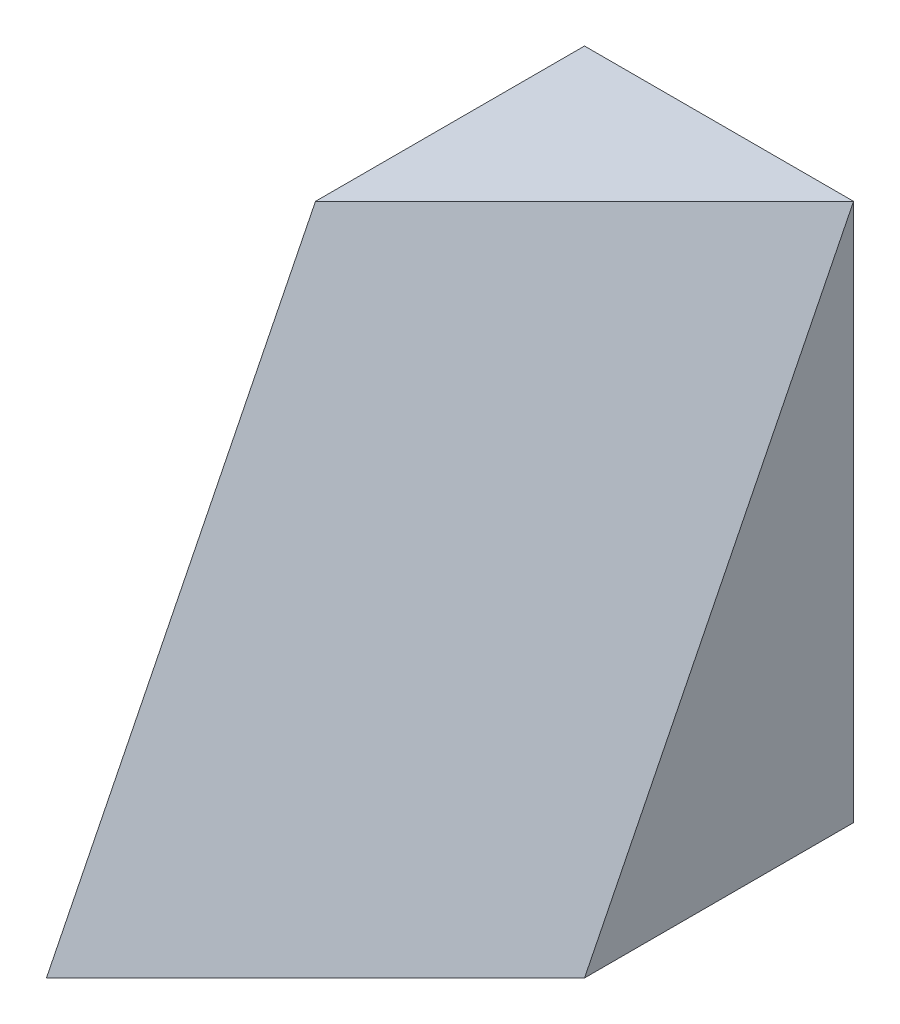
ISO-10303-21;
HEADER;
FILE_DESCRIPTION(('STEP AP214'),'2;1');
FILE_NAME('part.step','',(''),(''),'','','');
FILE_SCHEMA(('AUTOMOTIVE_DESIGN { 1 0 10303 214 1 1 1 1 }'));
ENDSEC;
DATA;
#1=APPLICATION_CONTEXT('core data for automotive mechanical design processes');
#2=APPLICATION_PROTOCOL_DEFINITION('international standard','automotive_design',2000,#1);
#3=PRODUCT_CONTEXT('',#1,'mechanical');
#4=PRODUCT('Part','Part','',(#3));
#5=PRODUCT_RELATED_PRODUCT_CATEGORY('part','',(#4));
#6=PRODUCT_DEFINITION_FORMATION('','',#4);
#7=PRODUCT_DEFINITION_CONTEXT('part definition',#1,'design');
#8=PRODUCT_DEFINITION('design','',#6,#7);
#9=PRODUCT_DEFINITION_SHAPE('','',#8);
#10=(LENGTH_UNIT() NAMED_UNIT(*) SI_UNIT(.MILLI.,.METRE.));
#11=(NAMED_UNIT(*) PLANE_ANGLE_UNIT() SI_UNIT($,.RADIAN.));
#12=(NAMED_UNIT(*) SI_UNIT($,.STERADIAN.) SOLID_ANGLE_UNIT());
#13=UNCERTAINTY_MEASURE_WITH_UNIT(LENGTH_MEASURE(1.E-05),#10,'distance_accuracy_value','');
#14=(GEOMETRIC_REPRESENTATION_CONTEXT(3) GLOBAL_UNCERTAINTY_ASSIGNED_CONTEXT((#13)) GLOBAL_UNIT_ASSIGNED_CONTEXT((#10,
#11,#12)) REPRESENTATION_CONTEXT('',''));
#15=CARTESIAN_POINT('',(0.,0.,0.));
#16=DIRECTION('',(0.,0.,1.));
#17=DIRECTION('',(1.,0.,0.));
#18=AXIS2_PLACEMENT_3D('',#15,#16,#17);
#19=CARTESIAN_POINT('',(0.,0.,40.));
#20=DIRECTION('',(0.,1.,0.));
#21=DIRECTION('',(0.,0.,1.));
#22=AXIS2_PLACEMENT_3D('',#19,#20,#21);
#23=PLANE('',#22);
#24=DIRECTION('',(0.,0.,-1.));
#25=VECTOR('',#24,1.);
#26=CARTESIAN_POINT('',(40.,0.,40.));
#27=LINE('',#26,#25);
#28=CARTESIAN_POINT('',(40.,0.,20.));
#29=VERTEX_POINT('',#28);
#30=CARTESIAN_POINT('',(40.,0.,0.));
#31=VERTEX_POINT('',#30);
#32=EDGE_CURVE('E40',#29,#31,#27,.T.);
#33=ORIENTED_EDGE('',*,*,#32,.F.);
#34=DIRECTION('',(0.707106781186548,0.,-0.707106781186547));
#35=VECTOR('',#34,1.);
#36=CARTESIAN_POINT('',(20.,0.,40.));
#37=LINE('',#36,#35);
#38=CARTESIAN_POINT('',(20.,0.,40.));
#39=VERTEX_POINT('',#38);
#40=EDGE_CURVE('E79',#39,#29,#37,.T.);
#41=ORIENTED_EDGE('',*,*,#40,.F.);
#42=DIRECTION('',(0.,0.,1.));
#43=VECTOR('',#42,1.);
#44=CARTESIAN_POINT('',(20.,0.,20.));
#45=LINE('',#44,#43);
#46=CARTESIAN_POINT('',(20.,0.,20.));
#47=VERTEX_POINT('',#46);
#48=EDGE_CURVE('E103',#47,#39,#45,.T.);
#49=ORIENTED_EDGE('',*,*,#48,.F.);
#50=DIRECTION('',(0.707106781186548,0.,0.707106781186547));
#51=VECTOR('',#50,1.);
#52=CARTESIAN_POINT('',(0.,0.,0.));
#53=LINE('',#52,#51);
#54=CARTESIAN_POINT('',(0.,0.,0.));
#55=VERTEX_POINT('',#54);
#56=EDGE_CURVE('E106',#55,#47,#53,.T.);
#57=ORIENTED_EDGE('',*,*,#56,.F.);
#58=DIRECTION('',(1.,0.,0.));
#59=VECTOR('',#58,1.);
#60=CARTESIAN_POINT('',(0.,0.,0.));
#61=LINE('',#60,#59);
#62=EDGE_CURVE('E92',#55,#31,#61,.T.);
#63=ORIENTED_EDGE('',*,*,#62,.T.);
#64=EDGE_LOOP('',(#33,#41,#49,#57,#63));
#65=FACE_BOUND('',#64,.T.);
#66=ADVANCED_FACE('F33',(#65),#23,.F.);
#67=CARTESIAN_POINT('',(40.,0.,40.));
#68=DIRECTION('',(-1.,0.,0.));
#69=DIRECTION('',(0.,0.,1.));
#70=AXIS2_PLACEMENT_3D('',#67,#68,#69);
#71=PLANE('',#70);
#72=DIRECTION('',(0.,1.,0.));
#73=VECTOR('',#72,1.);
#74=CARTESIAN_POINT('',(40.,0.,0.));
#75=LINE('',#74,#73);
#76=CARTESIAN_POINT('',(40.,40.,0.));
#77=VERTEX_POINT('',#76);
#78=EDGE_CURVE('E88',#31,#77,#75,.T.);
#79=ORIENTED_EDGE('',*,*,#78,.T.);
#80=DIRECTION('',(0.,-0.894427190999916,0.447213595499958));
#81=VECTOR('',#80,1.);
#82=CARTESIAN_POINT('',(40.,40.,0.));
#83=LINE('',#82,#81);
#84=EDGE_CURVE('E73',#77,#29,#83,.T.);
#85=ORIENTED_EDGE('',*,*,#84,.T.);
#86=ORIENTED_EDGE('',*,*,#32,.T.);
#87=EDGE_LOOP('',(#79,#85,#86));
#88=FACE_BOUND('',#87,.T.);
#89=ADVANCED_FACE('F89',(#88),#71,.F.);
#90=CARTESIAN_POINT('',(0.,40.,40.));
#91=DIRECTION('',(0.,-1.,0.));
#92=DIRECTION('',(0.,0.,-1.));
#93=AXIS2_PLACEMENT_3D('',#90,#91,#92);
#94=PLANE('',#93);
#95=DIRECTION('',(0.,0.,1.));
#96=VECTOR('',#95,1.);
#97=CARTESIAN_POINT('',(20.,40.,0.));
#98=LINE('',#97,#96);
#99=CARTESIAN_POINT('',(20.,40.,0.));
#100=VERTEX_POINT('',#99);
#101=CARTESIAN_POINT('',(20.,40.,20.));
#102=VERTEX_POINT('',#101);
#103=EDGE_CURVE('E46',#100,#102,#98,.T.);
#104=ORIENTED_EDGE('',*,*,#103,.T.);
#105=DIRECTION('',(0.707106781186547,0.,-0.707106781186548));
#106=VECTOR('',#105,1.);
#107=CARTESIAN_POINT('',(20.,40.,20.));
#108=LINE('',#107,#106);
#109=EDGE_CURVE('E76',#102,#77,#108,.T.);
#110=ORIENTED_EDGE('',*,*,#109,.T.);
#111=DIRECTION('',(-1.,0.,0.));
#112=VECTOR('',#111,1.);
#113=CARTESIAN_POINT('',(0.,40.,0.));
#114=LINE('',#113,#112);
#115=EDGE_CURVE('E85',#77,#100,#114,.T.);
#116=ORIENTED_EDGE('',*,*,#115,.T.);
#117=EDGE_LOOP('',(#104,#110,#116));
#118=FACE_BOUND('',#117,.T.);
#119=ADVANCED_FACE('F83',(#118),#94,.F.);
#120=CARTESIAN_POINT('',(0.,0.,0.));
#121=DIRECTION('',(0.,0.,-1.));
#122=DIRECTION('',(-1.,0.,0.));
#123=AXIS2_PLACEMENT_3D('',#120,#121,#122);
#124=PLANE('',#123);
#125=DIRECTION('',(0.447213595499958,0.894427190999916,0.));
#126=VECTOR('',#125,1.);
#127=CARTESIAN_POINT('',(0.,0.,0.));
#128=LINE('',#127,#126);
#129=EDGE_CURVE('E95',#55,#100,#128,.T.);
#130=ORIENTED_EDGE('',*,*,#129,.T.);
#131=ORIENTED_EDGE('',*,*,#115,.F.);
#132=ORIENTED_EDGE('',*,*,#78,.F.);
#133=ORIENTED_EDGE('',*,*,#62,.F.);
#134=EDGE_LOOP('',(#130,#131,#132,#133));
#135=FACE_BOUND('',#134,.T.);
#136=ADVANCED_FACE('F94',(#135),#124,.T.);
#137=CARTESIAN_POINT('',(0.,0.,0.));
#138=DIRECTION('',(0.894427190999916,-0.447213595499958,0.));
#139=DIRECTION('',(0.447213595499958,0.894427190999916,0.));
#140=AXIS2_PLACEMENT_3D('',#137,#138,#139);
#141=PLANE('',#140);
#142=ORIENTED_EDGE('',*,*,#129,.F.);
#143=DIRECTION('',(0.408248290463863,0.816496580927726,0.408248290463863));
#144=VECTOR('',#143,1.);
#145=CARTESIAN_POINT('',(0.,0.,0.));
#146=LINE('',#145,#144);
#147=EDGE_CURVE('E11',#55,#102,#146,.T.);
#148=ORIENTED_EDGE('',*,*,#147,.T.);
#149=ORIENTED_EDGE('',*,*,#103,.F.);
#150=EDGE_LOOP('',(#142,#148,#149));
#151=FACE_BOUND('',#150,.T.);
#152=ADVANCED_FACE('F119',(#151),#141,.F.);
#153=CARTESIAN_POINT('',(0.,40.,0.));
#154=DIRECTION('',(0.707106781186547,0.,-0.707106781186548));
#155=DIRECTION('',(-0.707106781186548,0.,-0.707106781186547));
#156=AXIS2_PLACEMENT_3D('',#153,#154,#155);
#157=PLANE('',#156);
#158=ORIENTED_EDGE('',*,*,#56,.T.);
#159=DIRECTION('',(0.,-1.,0.));
#160=VECTOR('',#159,1.);
#161=CARTESIAN_POINT('',(20.,40.,20.));
#162=LINE('',#161,#160);
#163=EDGE_CURVE('E101',#102,#47,#162,.T.);
#164=ORIENTED_EDGE('',*,*,#163,.F.);
#165=ORIENTED_EDGE('',*,*,#147,.F.);
#166=EDGE_LOOP('',(#158,#164,#165));
#167=FACE_BOUND('',#166,.T.);
#168=ADVANCED_FACE('F118',(#167),#157,.F.);
#169=CARTESIAN_POINT('',(20.,40.,20.));
#170=DIRECTION('',(1.,0.,0.));
#171=DIRECTION('',(0.,0.,-1.));
#172=AXIS2_PLACEMENT_3D('',#169,#170,#171);
#173=PLANE('',#172);
#174=ORIENTED_EDGE('',*,*,#48,.T.);
#175=DIRECTION('',(0.,-0.894427190999916,0.447213595499958));
#176=VECTOR('',#175,1.);
#177=CARTESIAN_POINT('',(20.,40.,20.));
#178=LINE('',#177,#176);
#179=EDGE_CURVE('E109',#102,#39,#178,.T.);
#180=ORIENTED_EDGE('',*,*,#179,.F.);
#181=ORIENTED_EDGE('',*,*,#163,.T.);
#182=EDGE_LOOP('',(#174,#180,#181));
#183=FACE_BOUND('',#182,.T.);
#184=ADVANCED_FACE('F116',(#183),#173,.F.);
#185=CARTESIAN_POINT('',(26.6666666666667,13.3333333333333,26.6666666666667));
#186=DIRECTION('',(-0.666666666666667,-0.333333333333334,-0.666666666666667));
#187=DIRECTION('',(-0.707106781186547,0.,0.707106781186548));
#188=AXIS2_PLACEMENT_3D('',#185,#186,#187);
#189=PLANE('',#188);
#190=ORIENTED_EDGE('',*,*,#109,.F.);
#191=ORIENTED_EDGE('',*,*,#179,.T.);
#192=ORIENTED_EDGE('',*,*,#40,.T.);
#193=ORIENTED_EDGE('',*,*,#84,.F.);
#194=EDGE_LOOP('',(#190,#191,#192,#193));
#195=FACE_BOUND('',#194,.T.);
#196=ADVANCED_FACE('F75',(#195),#189,.F.);
#197=CLOSED_SHELL('',(#66,#89,#119,#136,#152,#168,#184,#196));
#198=MANIFOLD_SOLID_BREP('B2',#197);
#199=ADVANCED_BREP_SHAPE_REPRESENTATION('',(#18,#198),#14);
#200=SHAPE_DEFINITION_REPRESENTATION(#9,#199);
ENDSEC;
END-ISO-10303-21;
